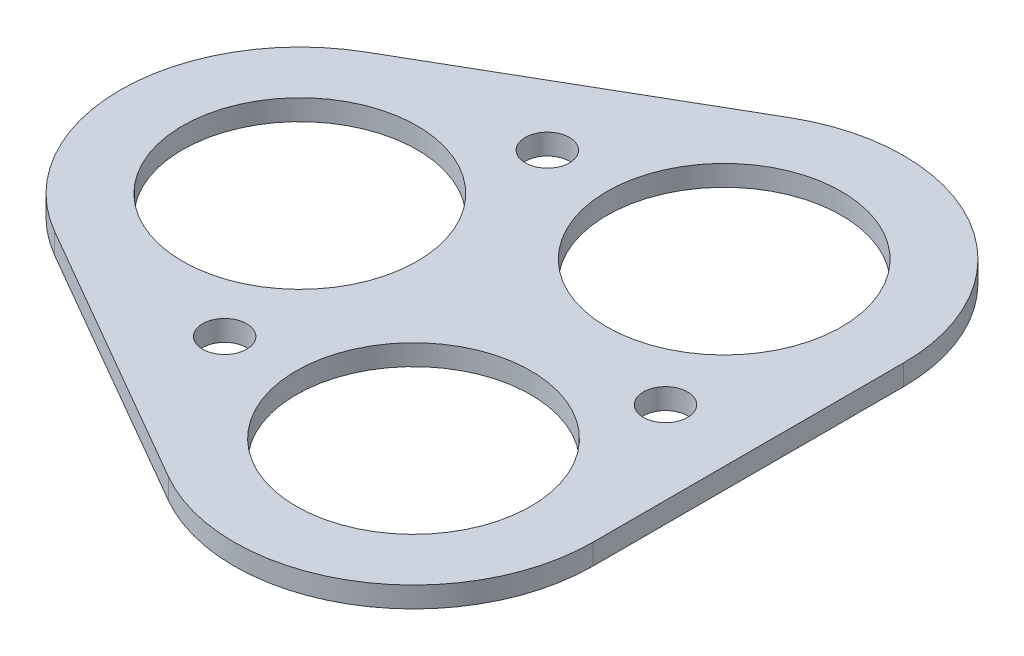
ISO-10303-21;
HEADER;
FILE_DESCRIPTION(('STEP AP214'),'2;1');
FILE_NAME('part.step','',(''),(''),'','','');
FILE_SCHEMA(('AUTOMOTIVE_DESIGN { 1 0 10303 214 1 1 1 1 }'));
ENDSEC;
DATA;
#1=APPLICATION_CONTEXT('core data for automotive mechanical design processes');
#2=APPLICATION_PROTOCOL_DEFINITION('international standard','automotive_design',2000,#1);
#3=PRODUCT_CONTEXT('',#1,'mechanical');
#4=PRODUCT('Part','Part','',(#3));
#5=PRODUCT_RELATED_PRODUCT_CATEGORY('part','',(#4));
#6=PRODUCT_DEFINITION_FORMATION('','',#4);
#7=PRODUCT_DEFINITION_CONTEXT('part definition',#1,'design');
#8=PRODUCT_DEFINITION('design','',#6,#7);
#9=PRODUCT_DEFINITION_SHAPE('','',#8);
#10=(LENGTH_UNIT() NAMED_UNIT(*) SI_UNIT(.MILLI.,.METRE.));
#11=(NAMED_UNIT(*) PLANE_ANGLE_UNIT() SI_UNIT($,.RADIAN.));
#12=(NAMED_UNIT(*) SI_UNIT($,.STERADIAN.) SOLID_ANGLE_UNIT());
#13=UNCERTAINTY_MEASURE_WITH_UNIT(LENGTH_MEASURE(1.E-05),#10,'distance_accuracy_value','');
#14=(GEOMETRIC_REPRESENTATION_CONTEXT(3) GLOBAL_UNCERTAINTY_ASSIGNED_CONTEXT((#13)) GLOBAL_UNIT_ASSIGNED_CONTEXT((#10,
#11,#12)) REPRESENTATION_CONTEXT('',''));
#15=CARTESIAN_POINT('',(0.,0.,0.));
#16=DIRECTION('',(0.,0.,1.));
#17=DIRECTION('',(1.,0.,0.));
#18=AXIS2_PLACEMENT_3D('',#15,#16,#17);
#19=CARTESIAN_POINT('',(-9.30432632419985,1.5,0.));
#20=DIRECTION('',(0.,1.,0.));
#21=DIRECTION('',(0.,0.,1.));
#22=AXIS2_PLACEMENT_3D('',#19,#20,#21);
#23=PLANE('',#22);
#24=CARTESIAN_POINT('',(17.1812452635102,1.5,0.));
#25=DIRECTION('',(0.,1.,0.));
#26=DIRECTION('',(0.,0.,1.));
#27=AXIS2_PLACEMENT_3D('',#24,#25,#26);
#28=CIRCLE('',#27,1.59999999755117);
#29=CARTESIAN_POINT('',(17.1812452635102,1.5,1.59999999755114));
#30=VERTEX_POINT('',#29);
#31=EDGE_CURVE('E203',#30,#30,#28,.T.);
#32=ORIENTED_EDGE('',*,*,#31,.F.);
#33=EDGE_LOOP('',(#32));
#34=FACE_BOUND('',#33,.T.);
#35=CARTESIAN_POINT('',(10.18124526095,1.5,11.25));
#36=DIRECTION('',(0.,1.,0.));
#37=DIRECTION('',(0.,0.,1.));
#38=AXIS2_PLACEMENT_3D('',#35,#36,#37);
#39=CIRCLE('',#38,8.5);
#40=CARTESIAN_POINT('',(10.18124526095,1.5,19.75));
#41=VERTEX_POINT('',#40);
#42=EDGE_CURVE('E215',#41,#41,#39,.T.);
#43=ORIENTED_EDGE('',*,*,#42,.F.);
#44=EDGE_LOOP('',(#43));
#45=FACE_BOUND('',#44,.T.);
#46=CARTESIAN_POINT('',(-9.30432632419985,1.5,0.));
#47=DIRECTION('',(0.,1.,0.));
#48=DIRECTION('',(0.,0.,1.));
#49=AXIS2_PLACEMENT_3D('',#46,#47,#48);
#50=CIRCLE('',#49,8.5);
#51=CARTESIAN_POINT('',(-9.30432632419985,1.5,8.50000000000006));
#52=VERTEX_POINT('',#51);
#53=EDGE_CURVE('E128',#52,#52,#50,.T.);
#54=ORIENTED_EDGE('',*,*,#53,.F.);
#55=EDGE_LOOP('',(#54));
#56=FACE_BOUND('',#55,.T.);
#57=CARTESIAN_POINT('',(-9.30432632419985,1.5,0.));
#58=DIRECTION('',(0.,1.,0.));
#59=DIRECTION('',(0.,0.,1.));
#60=AXIS2_PLACEMENT_3D('',#57,#58,#59);
#61=CIRCLE('',#60,13.);
#62=CARTESIAN_POINT('',(-15.8043263241999,1.5,-11.2583302491977));
#63=VERTEX_POINT('',#62);
#64=CARTESIAN_POINT('',(-15.8043263241998,1.5,11.2583302491978));
#65=VERTEX_POINT('',#64);
#66=EDGE_CURVE('E135',#63,#65,#61,.T.);
#67=ORIENTED_EDGE('',*,*,#66,.T.);
#68=DIRECTION('',(0.86602540378444,0.,0.499999999999997));
#69=VECTOR('',#68,1.);
#70=CARTESIAN_POINT('',(-15.8043263241998,1.5,11.2583302491978));
#71=LINE('',#70,#69);
#72=CARTESIAN_POINT('',(3.68124526095004,1.5,22.5083302491978));
#73=VERTEX_POINT('',#72);
#74=EDGE_CURVE('E93',#65,#73,#71,.T.);
#75=ORIENTED_EDGE('',*,*,#74,.T.);
#76=CARTESIAN_POINT('',(10.18124526095,1.5,11.25));
#77=DIRECTION('',(0.,1.,0.));
#78=DIRECTION('',(0.,0.,1.));
#79=AXIS2_PLACEMENT_3D('',#76,#77,#78);
#80=CIRCLE('',#79,13.);
#81=CARTESIAN_POINT('',(23.1812452609501,1.5,11.2499999999999));
#82=VERTEX_POINT('',#81);
#83=EDGE_CURVE('E106',#73,#82,#80,.T.);
#84=ORIENTED_EDGE('',*,*,#83,.T.);
#85=DIRECTION('',(0.,0.,-1.));
#86=VECTOR('',#85,1.);
#87=CARTESIAN_POINT('',(23.1812452609501,1.5,11.2499999999999));
#88=LINE('',#87,#86);
#89=CARTESIAN_POINT('',(23.18124526095,1.5,-11.25));
#90=VERTEX_POINT('',#89);
#91=EDGE_CURVE('E100',#82,#90,#88,.T.);
#92=ORIENTED_EDGE('',*,*,#91,.T.);
#93=CARTESIAN_POINT('',(10.18124526095,1.5,-11.25));
#94=DIRECTION('',(0.,1.,0.));
#95=DIRECTION('',(0.,0.,1.));
#96=AXIS2_PLACEMENT_3D('',#93,#94,#95);
#97=CIRCLE('',#96,13.);
#98=CARTESIAN_POINT('',(3.6812452609499,1.5,-22.5083302491977));
#99=VERTEX_POINT('',#98);
#100=EDGE_CURVE('E104',#90,#99,#97,.T.);
#101=ORIENTED_EDGE('',*,*,#100,.T.);
#102=DIRECTION('',(-0.866025403784437,0.,0.500000000000003));
#103=VECTOR('',#102,1.);
#104=CARTESIAN_POINT('',(3.6812452609499,1.5,-22.5083302491977));
#105=LINE('',#104,#103);
#106=EDGE_CURVE('E56',#99,#63,#105,.T.);
#107=ORIENTED_EDGE('',*,*,#106,.T.);
#108=EDGE_LOOP('',(#67,#75,#84,#92,#101,#107));
#109=FACE_BOUND('',#108,.T.);
#110=CARTESIAN_POINT('',(-3.06154026999395,1.5,-11.6871778582266));
#111=DIRECTION('',(0.,1.,0.));
#112=DIRECTION('',(0.,0.,1.));
#113=AXIS2_PLACEMENT_3D('',#110,#111,#112);
#114=CIRCLE('',#113,1.60000000000019);
#115=CARTESIAN_POINT('',(-3.06154026999395,1.5,-10.0871778582264));
#116=VERTEX_POINT('',#115);
#117=EDGE_CURVE('E221',#116,#116,#114,.T.);
#118=ORIENTED_EDGE('',*,*,#117,.F.);
#119=EDGE_LOOP('',(#118));
#120=FACE_BOUND('',#119,.T.);
#121=CARTESIAN_POINT('',(10.18124526095,1.5,-11.25));
#122=DIRECTION('',(0.,1.,0.));
#123=DIRECTION('',(0.,0.,1.));
#124=AXIS2_PLACEMENT_3D('',#121,#122,#123);
#125=CIRCLE('',#124,8.5);
#126=CARTESIAN_POINT('',(10.18124526095,1.5,-2.74999999999997));
#127=VERTEX_POINT('',#126);
#128=EDGE_CURVE('E209',#127,#127,#125,.T.);
#129=ORIENTED_EDGE('',*,*,#128,.F.);
#130=EDGE_LOOP('',(#129));
#131=FACE_BOUND('',#130,.T.);
#132=CARTESIAN_POINT('',(-3.06154026999395,1.5,11.687177373333));
#133=DIRECTION('',(0.,1.,0.));
#134=DIRECTION('',(0.,0.,1.));
#135=AXIS2_PLACEMENT_3D('',#132,#133,#134);
#136=CIRCLE('',#135,1.59999999999997);
#137=CARTESIAN_POINT('',(-3.06154026999395,1.5,13.287177373333));
#138=VERTEX_POINT('',#137);
#139=EDGE_CURVE('E194',#138,#138,#136,.T.);
#140=ORIENTED_EDGE('',*,*,#139,.F.);
#141=EDGE_LOOP('',(#140));
#142=FACE_BOUND('',#141,.T.);
#143=ADVANCED_FACE('F39',(#34,#45,#56,#109,#120,#131,#142),#23,.T.);
#144=CARTESIAN_POINT('',(-9.30432632419985,0.,0.));
#145=DIRECTION('',(0.,1.,0.));
#146=DIRECTION('',(0.,0.,1.));
#147=AXIS2_PLACEMENT_3D('',#144,#145,#146);
#148=PLANE('',#147);
#149=CARTESIAN_POINT('',(-9.30432632419985,0.,0.));
#150=DIRECTION('',(0.,1.,0.));
#151=DIRECTION('',(0.,0.,1.));
#152=AXIS2_PLACEMENT_3D('',#149,#150,#151);
#153=CIRCLE('',#152,13.);
#154=CARTESIAN_POINT('',(-15.8043263241999,0.,-11.2583302491977));
#155=VERTEX_POINT('',#154);
#156=CARTESIAN_POINT('',(-15.8043263241998,0.,11.2583302491978));
#157=VERTEX_POINT('',#156);
#158=EDGE_CURVE('E124',#155,#157,#153,.T.);
#159=ORIENTED_EDGE('',*,*,#158,.F.);
#160=DIRECTION('',(-0.866025403784437,0.,0.500000000000003));
#161=VECTOR('',#160,1.);
#162=CARTESIAN_POINT('',(3.6812452609499,0.,-22.5083302491977));
#163=LINE('',#162,#161);
#164=CARTESIAN_POINT('',(3.6812452609499,0.,-22.5083302491977));
#165=VERTEX_POINT('',#164);
#166=EDGE_CURVE('E85',#165,#155,#163,.T.);
#167=ORIENTED_EDGE('',*,*,#166,.F.);
#168=CARTESIAN_POINT('',(10.18124526095,0.,-11.25));
#169=DIRECTION('',(0.,1.,0.));
#170=DIRECTION('',(0.,0.,1.));
#171=AXIS2_PLACEMENT_3D('',#168,#169,#170);
#172=CIRCLE('',#171,13.);
#173=CARTESIAN_POINT('',(23.18124526095,0.,-11.25));
#174=VERTEX_POINT('',#173);
#175=EDGE_CURVE('E79',#174,#165,#172,.T.);
#176=ORIENTED_EDGE('',*,*,#175,.F.);
#177=DIRECTION('',(0.,0.,-1.));
#178=VECTOR('',#177,1.);
#179=CARTESIAN_POINT('',(23.1812452609501,0.,11.2499999999999));
#180=LINE('',#179,#178);
#181=CARTESIAN_POINT('',(23.1812452609501,0.,11.2499999999999));
#182=VERTEX_POINT('',#181);
#183=EDGE_CURVE('E114',#182,#174,#180,.T.);
#184=ORIENTED_EDGE('',*,*,#183,.F.);
#185=CARTESIAN_POINT('',(10.18124526095,0.,11.25));
#186=DIRECTION('',(0.,1.,0.));
#187=DIRECTION('',(0.,0.,1.));
#188=AXIS2_PLACEMENT_3D('',#185,#186,#187);
#189=CIRCLE('',#188,13.);
#190=CARTESIAN_POINT('',(3.68124526095004,0.,22.5083302491978));
#191=VERTEX_POINT('',#190);
#192=EDGE_CURVE('E130',#191,#182,#189,.T.);
#193=ORIENTED_EDGE('',*,*,#192,.F.);
#194=DIRECTION('',(0.86602540378444,0.,0.499999999999997));
#195=VECTOR('',#194,1.);
#196=CARTESIAN_POINT('',(-15.8043263241998,0.,11.2583302491978));
#197=LINE('',#196,#195);
#198=EDGE_CURVE('E127',#157,#191,#197,.T.);
#199=ORIENTED_EDGE('',*,*,#198,.F.);
#200=EDGE_LOOP('',(#159,#167,#176,#184,#193,#199));
#201=FACE_BOUND('',#200,.T.);
#202=CARTESIAN_POINT('',(-9.30432632419985,0.,0.));
#203=DIRECTION('',(0.,1.,0.));
#204=DIRECTION('',(0.,0.,1.));
#205=AXIS2_PLACEMENT_3D('',#202,#203,#204);
#206=CIRCLE('',#205,8.5);
#207=CARTESIAN_POINT('',(-9.30432632419985,0.,8.50000000000006));
#208=VERTEX_POINT('',#207);
#209=EDGE_CURVE('E224',#208,#208,#206,.T.);
#210=ORIENTED_EDGE('',*,*,#209,.T.);
#211=EDGE_LOOP('',(#210));
#212=FACE_BOUND('',#211,.T.);
#213=CARTESIAN_POINT('',(-3.06154026999395,0.,-11.6871778582266));
#214=DIRECTION('',(0.,1.,0.));
#215=DIRECTION('',(0.,0.,1.));
#216=AXIS2_PLACEMENT_3D('',#213,#214,#215);
#217=CIRCLE('',#216,1.60000000000019);
#218=CARTESIAN_POINT('',(-3.06154026999395,0.,-10.0871778582264));
#219=VERTEX_POINT('',#218);
#220=EDGE_CURVE('E218',#219,#219,#217,.T.);
#221=ORIENTED_EDGE('',*,*,#220,.T.);
#222=EDGE_LOOP('',(#221));
#223=FACE_BOUND('',#222,.T.);
#224=CARTESIAN_POINT('',(10.18124526095,0.,11.25));
#225=DIRECTION('',(0.,1.,0.));
#226=DIRECTION('',(0.,0.,1.));
#227=AXIS2_PLACEMENT_3D('',#224,#225,#226);
#228=CIRCLE('',#227,8.5);
#229=CARTESIAN_POINT('',(10.18124526095,0.,19.75));
#230=VERTEX_POINT('',#229);
#231=EDGE_CURVE('E212',#230,#230,#228,.T.);
#232=ORIENTED_EDGE('',*,*,#231,.T.);
#233=EDGE_LOOP('',(#232));
#234=FACE_BOUND('',#233,.T.);
#235=CARTESIAN_POINT('',(10.18124526095,0.,-11.25));
#236=DIRECTION('',(0.,1.,0.));
#237=DIRECTION('',(0.,0.,1.));
#238=AXIS2_PLACEMENT_3D('',#235,#236,#237);
#239=CIRCLE('',#238,8.5);
#240=CARTESIAN_POINT('',(10.18124526095,0.,-2.74999999999997));
#241=VERTEX_POINT('',#240);
#242=EDGE_CURVE('E206',#241,#241,#239,.T.);
#243=ORIENTED_EDGE('',*,*,#242,.T.);
#244=EDGE_LOOP('',(#243));
#245=FACE_BOUND('',#244,.T.);
#246=CARTESIAN_POINT('',(17.1812452635102,0.,0.));
#247=DIRECTION('',(0.,1.,0.));
#248=DIRECTION('',(0.,0.,1.));
#249=AXIS2_PLACEMENT_3D('',#246,#247,#248);
#250=CIRCLE('',#249,1.59999999755117);
#251=CARTESIAN_POINT('',(17.1812452635102,0.,1.59999999755114));
#252=VERTEX_POINT('',#251);
#253=EDGE_CURVE('E200',#252,#252,#250,.T.);
#254=ORIENTED_EDGE('',*,*,#253,.T.);
#255=EDGE_LOOP('',(#254));
#256=FACE_BOUND('',#255,.T.);
#257=CARTESIAN_POINT('',(-3.06154026999395,0.,11.687177373333));
#258=DIRECTION('',(0.,1.,0.));
#259=DIRECTION('',(0.,0.,1.));
#260=AXIS2_PLACEMENT_3D('',#257,#258,#259);
#261=CIRCLE('',#260,1.59999999999997);
#262=CARTESIAN_POINT('',(-3.06154026999395,0.,13.287177373333));
#263=VERTEX_POINT('',#262);
#264=EDGE_CURVE('E197',#263,#263,#261,.T.);
#265=ORIENTED_EDGE('',*,*,#264,.T.);
#266=EDGE_LOOP('',(#265));
#267=FACE_BOUND('',#266,.T.);
#268=ADVANCED_FACE('F144',(#201,#212,#223,#234,#245,#256,#267),#148,.F.);
#269=CARTESIAN_POINT('',(-9.30432632419985,1.5,0.));
#270=DIRECTION('',(0.,-1.,0.));
#271=DIRECTION('',(0.,0.,-1.));
#272=AXIS2_PLACEMENT_3D('',#269,#270,#271);
#273=CYLINDRICAL_SURFACE('',#272,13.);
#274=ORIENTED_EDGE('',*,*,#158,.T.);
#275=DIRECTION('',(0.,-1.,0.));
#276=VECTOR('',#275,1.);
#277=CARTESIAN_POINT('',(-15.8043263241998,1.5,11.2583302491978));
#278=LINE('',#277,#276);
#279=EDGE_CURVE('E11',#65,#157,#278,.T.);
#280=ORIENTED_EDGE('',*,*,#279,.F.);
#281=ORIENTED_EDGE('',*,*,#66,.F.);
#282=DIRECTION('',(0.,-1.,0.));
#283=VECTOR('',#282,1.);
#284=CARTESIAN_POINT('',(-15.8043263241999,1.5,-11.2583302491977));
#285=LINE('',#284,#283);
#286=EDGE_CURVE('E120',#63,#155,#285,.T.);
#287=ORIENTED_EDGE('',*,*,#286,.T.);
#288=EDGE_LOOP('',(#274,#280,#281,#287));
#289=FACE_BOUND('',#288,.T.);
#290=ADVANCED_FACE('F41',(#289),#273,.T.);
#291=CARTESIAN_POINT('',(-15.8043263241998,1.5,11.2583302491978));
#292=DIRECTION('',(0.499999999999997,0.,-0.86602540378444));
#293=DIRECTION('',(-0.86602540378444,0.,-0.499999999999997));
#294=AXIS2_PLACEMENT_3D('',#291,#292,#293);
#295=PLANE('',#294);
#296=ORIENTED_EDGE('',*,*,#198,.T.);
#297=DIRECTION('',(0.,-1.,0.));
#298=VECTOR('',#297,1.);
#299=CARTESIAN_POINT('',(3.68124526095004,1.5,22.5083302491978));
#300=LINE('',#299,#298);
#301=EDGE_CURVE('E48',#73,#191,#300,.T.);
#302=ORIENTED_EDGE('',*,*,#301,.F.);
#303=ORIENTED_EDGE('',*,*,#74,.F.);
#304=ORIENTED_EDGE('',*,*,#279,.T.);
#305=EDGE_LOOP('',(#296,#302,#303,#304));
#306=FACE_BOUND('',#305,.T.);
#307=ADVANCED_FACE('F306',(#306),#295,.F.);
#308=CARTESIAN_POINT('',(10.18124526095,1.5,11.25));
#309=DIRECTION('',(0.,-1.,0.));
#310=DIRECTION('',(0.,0.,-1.));
#311=AXIS2_PLACEMENT_3D('',#308,#309,#310);
#312=CYLINDRICAL_SURFACE('',#311,13.);
#313=ORIENTED_EDGE('',*,*,#192,.T.);
#314=DIRECTION('',(0.,-1.,0.));
#315=VECTOR('',#314,1.);
#316=CARTESIAN_POINT('',(23.1812452609501,1.5,11.2499999999999));
#317=LINE('',#316,#315);
#318=EDGE_CURVE('E115',#82,#182,#317,.T.);
#319=ORIENTED_EDGE('',*,*,#318,.F.);
#320=ORIENTED_EDGE('',*,*,#83,.F.);
#321=ORIENTED_EDGE('',*,*,#301,.T.);
#322=EDGE_LOOP('',(#313,#319,#320,#321));
#323=FACE_BOUND('',#322,.T.);
#324=ADVANCED_FACE('F141',(#323),#312,.T.);
#325=CARTESIAN_POINT('',(23.1812452609501,1.5,11.2499999999999));
#326=DIRECTION('',(-1.,0.,0.));
#327=DIRECTION('',(0.,0.,1.));
#328=AXIS2_PLACEMENT_3D('',#325,#326,#327);
#329=PLANE('',#328);
#330=ORIENTED_EDGE('',*,*,#183,.T.);
#331=DIRECTION('',(0.,-1.,0.));
#332=VECTOR('',#331,1.);
#333=CARTESIAN_POINT('',(23.18124526095,1.5,-11.25));
#334=LINE('',#333,#332);
#335=EDGE_CURVE('E111',#90,#174,#334,.T.);
#336=ORIENTED_EDGE('',*,*,#335,.F.);
#337=ORIENTED_EDGE('',*,*,#91,.F.);
#338=ORIENTED_EDGE('',*,*,#318,.T.);
#339=EDGE_LOOP('',(#330,#336,#337,#338));
#340=FACE_BOUND('',#339,.T.);
#341=ADVANCED_FACE('F112',(#340),#329,.F.);
#342=CARTESIAN_POINT('',(10.18124526095,1.5,-11.25));
#343=DIRECTION('',(0.,-1.,0.));
#344=DIRECTION('',(0.,0.,-1.));
#345=AXIS2_PLACEMENT_3D('',#342,#343,#344);
#346=CYLINDRICAL_SURFACE('',#345,13.);
#347=ORIENTED_EDGE('',*,*,#175,.T.);
#348=DIRECTION('',(0.,-1.,0.));
#349=VECTOR('',#348,1.);
#350=CARTESIAN_POINT('',(3.6812452609499,1.5,-22.5083302491977));
#351=LINE('',#350,#349);
#352=EDGE_CURVE('E116',#99,#165,#351,.T.);
#353=ORIENTED_EDGE('',*,*,#352,.F.);
#354=ORIENTED_EDGE('',*,*,#100,.F.);
#355=ORIENTED_EDGE('',*,*,#335,.T.);
#356=EDGE_LOOP('',(#347,#353,#354,#355));
#357=FACE_BOUND('',#356,.T.);
#358=ADVANCED_FACE('F118',(#357),#346,.T.);
#359=CARTESIAN_POINT('',(3.6812452609499,1.5,-22.5083302491977));
#360=DIRECTION('',(0.500000000000003,0.,0.866025403784437));
#361=DIRECTION('',(0.866025403784437,0.,-0.500000000000003));
#362=AXIS2_PLACEMENT_3D('',#359,#360,#361);
#363=PLANE('',#362);
#364=ORIENTED_EDGE('',*,*,#166,.T.);
#365=ORIENTED_EDGE('',*,*,#286,.F.);
#366=ORIENTED_EDGE('',*,*,#106,.F.);
#367=ORIENTED_EDGE('',*,*,#352,.T.);
#368=EDGE_LOOP('',(#364,#365,#366,#367));
#369=FACE_BOUND('',#368,.T.);
#370=ADVANCED_FACE('F149',(#369),#363,.F.);
#371=CARTESIAN_POINT('',(-9.30432632419985,1.5,0.));
#372=DIRECTION('',(0.,-1.,0.));
#373=DIRECTION('',(0.,0.,-1.));
#374=AXIS2_PLACEMENT_3D('',#371,#372,#373);
#375=CYLINDRICAL_SURFACE('',#374,8.5);
#376=ORIENTED_EDGE('',*,*,#53,.T.);
#377=EDGE_LOOP('',(#376));
#378=FACE_BOUND('',#377,.T.);
#379=ORIENTED_EDGE('',*,*,#209,.F.);
#380=EDGE_LOOP('',(#379));
#381=FACE_BOUND('',#380,.T.);
#382=ADVANCED_FACE('F151',(#378,#381),#375,.F.);
#383=CARTESIAN_POINT('',(-3.06154026999395,1.5,-11.6871778582266));
#384=DIRECTION('',(0.,-1.,0.));
#385=DIRECTION('',(0.,0.,-1.));
#386=AXIS2_PLACEMENT_3D('',#383,#384,#385);
#387=CYLINDRICAL_SURFACE('',#386,1.60000000000019);
#388=ORIENTED_EDGE('',*,*,#117,.T.);
#389=EDGE_LOOP('',(#388));
#390=FACE_BOUND('',#389,.T.);
#391=ORIENTED_EDGE('',*,*,#220,.F.);
#392=EDGE_LOOP('',(#391));
#393=FACE_BOUND('',#392,.T.);
#394=ADVANCED_FACE('F157',(#390,#393),#387,.F.);
#395=CARTESIAN_POINT('',(10.18124526095,1.5,11.25));
#396=DIRECTION('',(0.,-1.,0.));
#397=DIRECTION('',(0.,0.,-1.));
#398=AXIS2_PLACEMENT_3D('',#395,#396,#397);
#399=CYLINDRICAL_SURFACE('',#398,8.5);
#400=ORIENTED_EDGE('',*,*,#42,.T.);
#401=EDGE_LOOP('',(#400));
#402=FACE_BOUND('',#401,.T.);
#403=ORIENTED_EDGE('',*,*,#231,.F.);
#404=EDGE_LOOP('',(#403));
#405=FACE_BOUND('',#404,.T.);
#406=ADVANCED_FACE('F173',(#402,#405),#399,.F.);
#407=CARTESIAN_POINT('',(10.18124526095,1.5,-11.25));
#408=DIRECTION('',(0.,-1.,0.));
#409=DIRECTION('',(0.,0.,-1.));
#410=AXIS2_PLACEMENT_3D('',#407,#408,#409);
#411=CYLINDRICAL_SURFACE('',#410,8.5);
#412=ORIENTED_EDGE('',*,*,#128,.T.);
#413=EDGE_LOOP('',(#412));
#414=FACE_BOUND('',#413,.T.);
#415=ORIENTED_EDGE('',*,*,#242,.F.);
#416=EDGE_LOOP('',(#415));
#417=FACE_BOUND('',#416,.T.);
#418=ADVANCED_FACE('F177',(#414,#417),#411,.F.);
#419=CARTESIAN_POINT('',(17.1812452635102,1.5,0.));
#420=DIRECTION('',(0.,-1.,0.));
#421=DIRECTION('',(0.,0.,-1.));
#422=AXIS2_PLACEMENT_3D('',#419,#420,#421);
#423=CYLINDRICAL_SURFACE('',#422,1.59999999755117);
#424=ORIENTED_EDGE('',*,*,#31,.T.);
#425=EDGE_LOOP('',(#424));
#426=FACE_BOUND('',#425,.T.);
#427=ORIENTED_EDGE('',*,*,#253,.F.);
#428=EDGE_LOOP('',(#427));
#429=FACE_BOUND('',#428,.T.);
#430=ADVANCED_FACE('F181',(#426,#429),#423,.F.);
#431=CARTESIAN_POINT('',(-3.06154026999395,1.5,11.687177373333));
#432=DIRECTION('',(0.,-1.,0.));
#433=DIRECTION('',(0.,0.,-1.));
#434=AXIS2_PLACEMENT_3D('',#431,#432,#433);
#435=CYLINDRICAL_SURFACE('',#434,1.59999999999997);
#436=ORIENTED_EDGE('',*,*,#139,.T.);
#437=EDGE_LOOP('',(#436));
#438=FACE_BOUND('',#437,.T.);
#439=ORIENTED_EDGE('',*,*,#264,.F.);
#440=EDGE_LOOP('',(#439));
#441=FACE_BOUND('',#440,.T.);
#442=ADVANCED_FACE('F185',(#438,#441),#435,.F.);
#443=CLOSED_SHELL('',(#143,#268,#290,#307,#324,#341,#358,#370,#382,#394,#406,#418,#430,#442));
#444=MANIFOLD_SOLID_BREP('B2',#443);
#445=ADVANCED_BREP_SHAPE_REPRESENTATION('',(#18,#444),#14);
#446=SHAPE_DEFINITION_REPRESENTATION(#9,#445);
ENDSEC;
END-ISO-10303-21;
